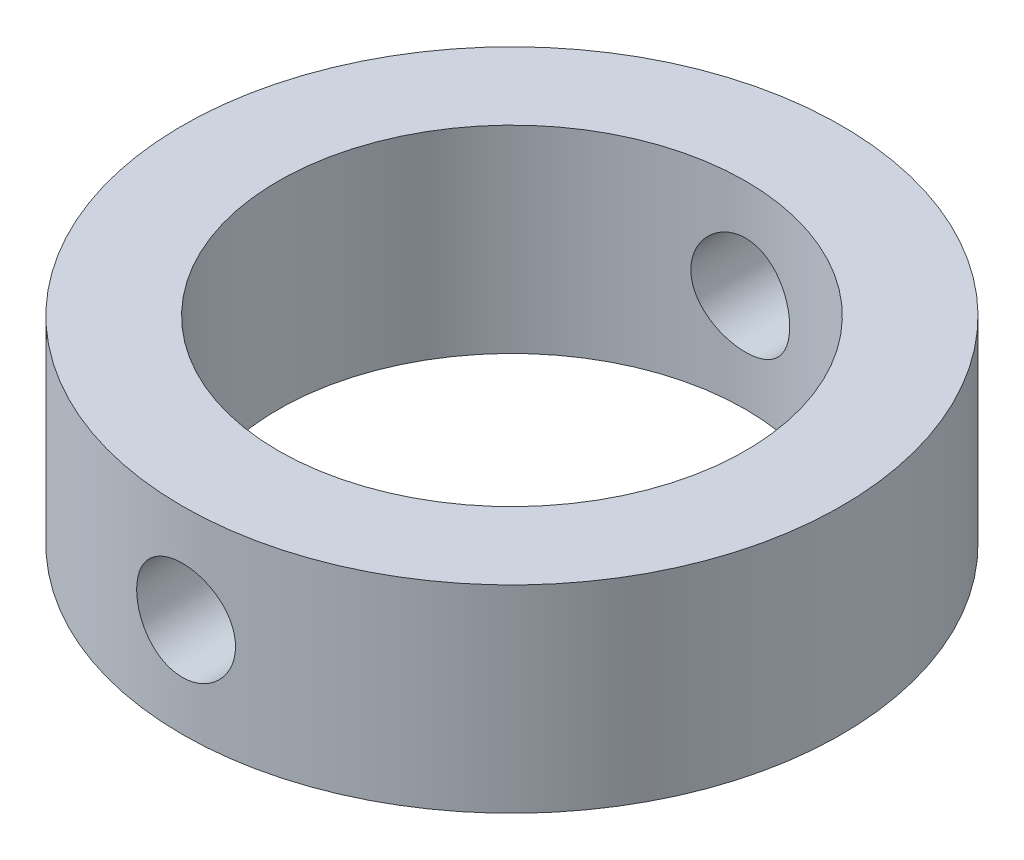
ISO-10303-21;
HEADER;
FILE_DESCRIPTION(('STEP AP214'),'2;1');
FILE_NAME('part.step','',(''),(''),'','','');
FILE_SCHEMA(('AUTOMOTIVE_DESIGN { 1 0 10303 214 1 1 1 1 }'));
ENDSEC;
DATA;
#1=APPLICATION_CONTEXT('core data for automotive mechanical design processes');
#2=APPLICATION_PROTOCOL_DEFINITION('international standard','automotive_design',2000,#1);
#3=PRODUCT_CONTEXT('',#1,'mechanical');
#4=PRODUCT('Part','Part','',(#3));
#5=PRODUCT_RELATED_PRODUCT_CATEGORY('part','',(#4));
#6=PRODUCT_DEFINITION_FORMATION('','',#4);
#7=PRODUCT_DEFINITION_CONTEXT('part definition',#1,'design');
#8=PRODUCT_DEFINITION('design','',#6,#7);
#9=PRODUCT_DEFINITION_SHAPE('','',#8);
#10=(LENGTH_UNIT() NAMED_UNIT(*) SI_UNIT(.MILLI.,.METRE.));
#11=(NAMED_UNIT(*) PLANE_ANGLE_UNIT() SI_UNIT($,.RADIAN.));
#12=(NAMED_UNIT(*) SI_UNIT($,.STERADIAN.) SOLID_ANGLE_UNIT());
#13=UNCERTAINTY_MEASURE_WITH_UNIT(LENGTH_MEASURE(1.E-05),#10,'distance_accuracy_value','');
#14=(GEOMETRIC_REPRESENTATION_CONTEXT(3) GLOBAL_UNCERTAINTY_ASSIGNED_CONTEXT((#13)) GLOBAL_UNIT_ASSIGNED_CONTEXT((#10,
#11,#12)) REPRESENTATION_CONTEXT('',''));
#15=CARTESIAN_POINT('',(0.,0.,0.));
#16=DIRECTION('',(0.,0.,1.));
#17=DIRECTION('',(1.,0.,0.));
#18=AXIS2_PLACEMENT_3D('',#15,#16,#17);
#19=CARTESIAN_POINT('',(0.,7.50000000000001,0.));
#20=DIRECTION('',(0.,1.,0.));
#21=DIRECTION('',(0.,0.,1.));
#22=AXIS2_PLACEMENT_3D('',#19,#20,#21);
#23=PLANE('',#22);
#24=CARTESIAN_POINT('',(0.,7.50000000000001,0.));
#25=DIRECTION('',(0.,1.,0.));
#26=DIRECTION('',(0.,0.,1.));
#27=AXIS2_PLACEMENT_3D('',#24,#25,#26);
#28=CIRCLE('',#27,25.);
#29=CARTESIAN_POINT('',(0.,7.50000000000001,25.));
#30=VERTEX_POINT('',#29);
#31=EDGE_CURVE('E12',#30,#30,#28,.T.);
#32=ORIENTED_EDGE('',*,*,#31,.T.);
#33=EDGE_LOOP('',(#32));
#34=FACE_BOUND('',#33,.T.);
#35=CARTESIAN_POINT('',(0.,7.50000000000001,0.));
#36=DIRECTION('',(0.,1.,0.));
#37=DIRECTION('',(0.,0.,1.));
#38=AXIS2_PLACEMENT_3D('',#35,#36,#37);
#39=CIRCLE('',#38,17.7222);
#40=CARTESIAN_POINT('',(0.,7.50000000000001,17.7222));
#41=VERTEX_POINT('',#40);
#42=EDGE_CURVE('E65',#41,#41,#39,.T.);
#43=ORIENTED_EDGE('',*,*,#42,.F.);
#44=EDGE_LOOP('',(#43));
#45=FACE_BOUND('',#44,.T.);
#46=ADVANCED_FACE('F46',(#34,#45),#23,.T.);
#47=CARTESIAN_POINT('',(0.,-7.50000000000001,0.));
#48=DIRECTION('',(0.,1.,0.));
#49=DIRECTION('',(0.,0.,1.));
#50=AXIS2_PLACEMENT_3D('',#47,#48,#49);
#51=PLANE('',#50);
#52=CARTESIAN_POINT('',(0.,-7.50000000000001,0.));
#53=DIRECTION('',(0.,1.,0.));
#54=DIRECTION('',(0.,0.,1.));
#55=AXIS2_PLACEMENT_3D('',#52,#53,#54);
#56=CIRCLE('',#55,25.);
#57=CARTESIAN_POINT('',(0.,-7.50000000000001,25.));
#58=VERTEX_POINT('',#57);
#59=EDGE_CURVE('E60',#58,#58,#56,.T.);
#60=ORIENTED_EDGE('',*,*,#59,.F.);
#61=EDGE_LOOP('',(#60));
#62=FACE_BOUND('',#61,.T.);
#63=CARTESIAN_POINT('',(0.,-7.50000000000001,0.));
#64=DIRECTION('',(0.,1.,0.));
#65=DIRECTION('',(0.,0.,1.));
#66=AXIS2_PLACEMENT_3D('',#63,#64,#65);
#67=CIRCLE('',#66,17.7222);
#68=CARTESIAN_POINT('',(0.,-7.50000000000001,17.7222));
#69=VERTEX_POINT('',#68);
#70=EDGE_CURVE('E68',#69,#69,#67,.T.);
#71=ORIENTED_EDGE('',*,*,#70,.T.);
#72=EDGE_LOOP('',(#71));
#73=FACE_BOUND('',#72,.T.);
#74=ADVANCED_FACE('F104',(#62,#73),#51,.F.);
#75=CARTESIAN_POINT('',(0.,7.50000000000001,0.));
#76=DIRECTION('',(0.,-1.,0.));
#77=DIRECTION('',(0.,0.,-1.));
#78=AXIS2_PLACEMENT_3D('',#75,#76,#77);
#79=CYLINDRICAL_SURFACE('',#78,25.);
#80=CARTESIAN_POINT('',(0.,3.74999999999998,-25.));
#81=CARTESIAN_POINT('',(-0.209378861204106,3.74999136546187,-24.9999966442824));
#82=CARTESIAN_POINT('',(-0.41887921270533,3.7324049978984,-24.997342063426));
#83=CARTESIAN_POINT('',(-0.832024069987285,3.66254200004314,-24.9870078993297));
#84=CARTESIAN_POINT('',(-1.03566267243558,3.61023159263779,-24.9793234234618));
#85=CARTESIAN_POINT('',(-1.43104521555465,3.47251873758097,-24.9597930304881));
#86=CARTESIAN_POINT('',(-1.62279801956699,3.38714130123514,-24.947950259273));
#87=CARTESIAN_POINT('',(-1.98922607158813,3.18577905145784,-24.9214118977931));
#88=CARTESIAN_POINT('',(-2.16390368681297,3.06979848895659,-24.9067167038193));
#89=CARTESIAN_POINT('',(-2.49261679890531,2.80955683765031,-24.8759792747863));
#90=CARTESIAN_POINT('',(-2.64649958056375,2.66510385947948,-24.8599283472583));
#91=CARTESIAN_POINT('',(-2.92793726672371,2.35243077776534,-24.828356528331));
#92=CARTESIAN_POINT('',(-3.0554906568234,2.18420930805372,-24.8128356674626));
#93=CARTESIAN_POINT('',(-3.28124323749857,1.8277483911938,-24.7839969364681));
#94=CARTESIAN_POINT('',(-3.37929467593011,1.63941438254668,-24.7706902993758));
#95=CARTESIAN_POINT('',(-3.54231580427639,1.24871794838645,-24.7479052826567));
#96=CARTESIAN_POINT('',(-3.60728729722907,1.04635628814029,-24.7384266943862));
#97=CARTESIAN_POINT('',(-3.70182996997278,0.634954895320726,-24.7244564054669));
#98=CARTESIAN_POINT('',(-3.73166259101294,0.425976516479948,-24.7199278935313));
#99=CARTESIAN_POINT('',(-3.75589060084831,0.00593458503179794,-24.7162587242645));
#100=CARTESIAN_POINT('',(-3.75028802434491,-0.205128847156248,-24.7171177575787));
#101=CARTESIAN_POINT('',(-3.70401833126969,-0.621502700485371,-24.7240929588102));
#102=CARTESIAN_POINT('',(-3.66364239819375,-0.826846316212019,-24.7301654690387));
#103=CARTESIAN_POINT('',(-3.54942793509335,-1.22781092217884,-24.7468152031592));
#104=CARTESIAN_POINT('',(-3.4755884584453,-1.42343163720187,-24.7573925544845));
#105=CARTESIAN_POINT('',(-3.29624008824341,-1.80028342820716,-24.781908388637));
#106=CARTESIAN_POINT('',(-3.19060785707994,-1.98145492273098,-24.7958599191632));
#107=CARTESIAN_POINT('',(-2.95076032822386,-2.32361148945484,-24.8255426893637));
#108=CARTESIAN_POINT('',(-2.81654315456195,-2.48459523567344,-24.8412740458125));
#109=CARTESIAN_POINT('',(-2.5217373269562,-2.7834941518493,-24.8729368264052));
#110=CARTESIAN_POINT('',(-2.360898324105,-2.92116247571585,-24.8888686778204));
#111=CARTESIAN_POINT('',(-2.01826772473546,-3.16758983626815,-24.9189911912115));
#112=CARTESIAN_POINT('',(-1.83647603647042,-3.27634874635974,-24.9331818455628));
#113=CARTESIAN_POINT('',(-1.45688649553421,-3.46188271624886,-24.9582378896348));
#114=CARTESIAN_POINT('',(-1.25907919459195,-3.53863872960074,-24.9691012981357));
#115=CARTESIAN_POINT('',(-0.853182956217649,-3.65777347421344,-24.9862622639267));
#116=CARTESIAN_POINT('',(-0.6450947148815,-3.70015452953895,-24.9925601298867));
#117=CARTESIAN_POINT('',(-0.226673919109115,-3.74900807454175,-24.9998395283468));
#118=CARTESIAN_POINT('',(-0.0163818296761745,-3.75581992844831,-25.0008713022597));
#119=CARTESIAN_POINT('',(0.402341694155708,-3.73424248672244,-24.9976390253807));
#120=CARTESIAN_POINT('',(0.610773185954693,-3.70585428082975,-24.9933751385342));
#121=CARTESIAN_POINT('',(1.01883096857852,-3.61496474955615,-24.9800617153833));
#122=CARTESIAN_POINT('',(1.2184949076996,-3.55262875992289,-24.9710353801996));
#123=CARTESIAN_POINT('',(1.6045373966075,-3.39578750634561,-24.9492058914592));
#124=CARTESIAN_POINT('',(1.79091532198775,-3.30128073166592,-24.9364025605391));
#125=CARTESIAN_POINT('',(2.1465874482298,-3.08198443859034,-24.9083170617172));
#126=CARTESIAN_POINT('',(2.31574752472892,-2.95697964996806,-24.8930175406686));
#127=CARTESIAN_POINT('',(2.63080918294427,-2.68053547092813,-24.8616965753041));
#128=CARTESIAN_POINT('',(2.77670941198351,-2.52909454418838,-24.8456750890717));
#129=CARTESIAN_POINT('',(3.04234462392989,-2.20256616705877,-24.8145566076123));
#130=CARTESIAN_POINT('',(3.16185211868553,-2.02729268701307,-24.7994684004397));
#131=CARTESIAN_POINT('',(3.36972823176461,-1.65895989872056,-24.7720804776226));
#132=CARTESIAN_POINT('',(3.4580976914109,-1.46590107119632,-24.7597806866407));
#133=CARTESIAN_POINT('',(3.60083668309858,-1.06815616594216,-24.7394258252161));
#134=CARTESIAN_POINT('',(3.65532592854089,-0.863513847571883,-24.731355825161));
#135=CARTESIAN_POINT('',(3.72913873753966,-0.447852461412236,-24.7203345574451));
#136=CARTESIAN_POINT('',(3.74846472957666,-0.236833835013324,-24.7173829362943));
#137=CARTESIAN_POINT('',(3.751344666736,0.183322658289436,-24.716945815271));
#138=CARTESIAN_POINT('',(3.73525630418282,0.392458104392283,-24.7194056583375));
#139=CARTESIAN_POINT('',(3.66853073860947,0.80501315830877,-24.7293955152794));
#140=CARTESIAN_POINT('',(3.61789359096568,1.00843277528346,-24.7369255210279));
#141=CARTESIAN_POINT('',(3.48363433796663,1.40368270558579,-24.7561881528074));
#142=CARTESIAN_POINT('',(3.40003723310785,1.59552167608359,-24.7679175929019));
#143=CARTESIAN_POINT('',(3.20226669105772,1.96250908450601,-24.7942613639425));
#144=CARTESIAN_POINT('',(3.08809221853755,2.13765695700913,-24.8088757925681));
#145=CARTESIAN_POINT('',(2.83110844147911,2.46810764493795,-24.8395185841234));
#146=CARTESIAN_POINT('',(2.68803422599514,2.62320333311767,-24.8555591970492));
#147=CARTESIAN_POINT('',(2.37787210270709,2.90731138696955,-24.8871447206659));
#148=CARTESIAN_POINT('',(2.21077862087735,3.03631768144039,-24.902689515269));
#149=CARTESIAN_POINT('',(1.8562392688593,3.2652191915184,-24.931629644763));
#150=CARTESIAN_POINT('',(1.6686864419119,3.36495027303686,-24.9450126782205));
#151=CARTESIAN_POINT('',(1.2793796756218,3.53134629189512,-24.968000720074));
#152=CARTESIAN_POINT('',(1.07764069274176,3.59804547513423,-24.9776096391439));
#153=CARTESIAN_POINT('',(0.72916431972332,3.68135335677528,-24.9897734815376));
#154=CARTESIAN_POINT('',(0.584577833738195,3.70705650384704,-24.9935887294889));
#155=CARTESIAN_POINT('',(0.293347429000313,3.7413827442816,-24.9987031486974));
#156=CARTESIAN_POINT('',(0.146703535836043,3.75000604988134,-25.0000023512194));
#157=CARTESIAN_POINT('',(0.,3.74999999999998,-25.));
#158=B_SPLINE_CURVE_WITH_KNOTS('',3,(#80,#81,#82,#83,#84,#85,#86,#87,#88,#89,#90,#91,#92,#93,
#94,#95,#96,#97,#98,#99,#100,#101,#102,#103,#104,#105,#106,#107,#108,#109,#110,#111,#112,#113,
#114,#115,#116,#117,#118,#119,#120,#121,#122,#123,#124,#125,#126,#127,#128,#129,#130,#131,#132,
#133,#134,#135,#136,#137,#138,#139,#140,#141,#142,#143,#144,#145,#146,#147,#148,#149,#150,#151,
#152,#153,#154,#155,#156,#157),.UNSPECIFIED.,.T.,.F.,(4,2,2,2,2,2,2,2,2,2,2,2,2,2,2,2,2,2,2,2,2,
2,2,2,2,2,2,2,2,2,2,2,2,2,2,2,2,2,4),(0.,0.62760051257916,1.25581240732287,1.88355005895809,
2.511200560494,3.14323540342108,3.77530658931448,4.41049255988435,5.04564390563763,
5.67603911514811,6.30639812747458,6.93152942989367,7.55667841725904,8.18428458690398,
8.81193195771337,9.44585728138522,10.0797853809667,10.7140902246219,11.348352179835,
11.9765514636064,12.6047312997789,13.2298787241487,13.8550555094068,14.4847797009227,
15.1145405007157,15.7495341646168,16.3845106702208,17.0172305864292,17.6499068034294,
18.2762222065266,18.9025366057391,19.5283768496037,20.154238286672,20.786120749143,
21.4181500867183,22.0536580846183,22.688505831536,23.1282462994702,23.5679813030823),.UNSPECIFIED.);
#159=CARTESIAN_POINT('',(0.,3.74999999999998,-25.));
#160=VERTEX_POINT('',#159);
#161=EDGE_CURVE('E93',#160,#160,#158,.T.);
#162=ORIENTED_EDGE('',*,*,#161,.T.);
#163=EDGE_LOOP('',(#162));
#164=FACE_BOUND('',#163,.T.);
#165=CARTESIAN_POINT('',(3.75,0.,24.7171499166065));
#166=CARTESIAN_POINT('',(3.74999135268076,-0.209363923243862,24.7171534162569));
#167=CARTESIAN_POINT('',(3.73240740970164,-0.4188493769331,24.7198387912912));
#168=CARTESIAN_POINT('',(3.66255491641441,-0.831963287259849,24.7302828678189));
#169=CARTESIAN_POINT('',(3.61025253506452,-1.03558582871036,24.7380465176796));
#170=CARTESIAN_POINT('',(3.47256315245608,-1.43093438859889,24.757748475261));
#171=CARTESIAN_POINT('',(3.38720154203599,-1.62266940635047,24.7696835784506));
#172=CARTESIAN_POINT('',(3.18587657719372,-1.98906757693512,24.7963798526664));
#173=CARTESIAN_POINT('',(3.06991743574651,-2.16373307553706,24.8111406345481));
#174=CARTESIAN_POINT('',(2.80969756046425,-2.49245954188449,24.8419572312449));
#175=CARTESIAN_POINT('',(2.66524013962059,-2.6463640335165,24.8580215614632));
#176=CARTESIAN_POINT('',(2.35254901361086,-2.9278437141391,24.8895592042144));
#177=CARTESIAN_POINT('',(2.1843140019663,-3.05541745541756,24.9050324842122));
#178=CARTESIAN_POINT('',(1.82784089513188,-3.2811915792283,24.9337336857078));
#179=CARTESIAN_POINT('',(1.63951056841442,-3.37924787580612,24.9469504608901));
#180=CARTESIAN_POINT('',(1.24882212526743,-3.54227899702046,24.9695551686593));
#181=CARTESIAN_POINT('',(1.04646475067669,-3.60725556960723,24.9789433035484));
#182=CARTESIAN_POINT('',(0.635077807726422,-3.70180847132708,24.9927728699448));
#183=CARTESIAN_POINT('',(0.426109710974664,-3.7316468159679,24.9972508971837));
#184=CARTESIAN_POINT('',(0.00608801004869675,-3.75588983706225,25.0008811192395));
#185=CARTESIAN_POINT('',(-0.204965477539366,-3.75029648329923,25.0000336101235));
#186=CARTESIAN_POINT('',(-0.621379295501299,-3.70404165559394,24.9931374915199));
#187=CARTESIAN_POINT('',(-0.826771728500019,-3.66366207052129,24.987130691312));
#188=CARTESIAN_POINT('',(-1.22783207285784,-3.54942348419356,24.9706375056963));
#189=CARTESIAN_POINT('',(-1.42349973378371,-3.4755636212464,24.9601510049935));
#190=CARTESIAN_POINT('',(-1.80040945192579,-3.29617250770726,24.9358048468301));
#191=CARTESIAN_POINT('',(-1.98159418080899,-3.19052258722815,24.921932587891));
#192=CARTESIAN_POINT('',(-2.32376976787545,-2.95063701582503,24.8923609561355));
#193=CARTESIAN_POINT('',(-2.48475929567934,-2.81639948323284,24.8766614630796));
#194=CARTESIAN_POINT('',(-2.78363620680661,-2.52157887793353,24.8450039548157));
#195=CARTESIAN_POINT('',(-2.92128082377367,-2.36074969507472,24.8290449155814));
#196=CARTESIAN_POINT('',(-3.16766498347032,-2.01814730719066,24.7988176113381));
#197=CARTESIAN_POINT('',(-3.27640434819997,-1.83637397320019,24.7845493567412));
#198=CARTESIAN_POINT('',(-3.46192411336512,-1.45679009264838,24.7593193821714));
#199=CARTESIAN_POINT('',(-3.53867955675204,-1.25896716584402,24.7483602461323));
#200=CARTESIAN_POINT('',(-3.65780840522199,-0.853036862131513,24.7310350724765));
#201=CARTESIAN_POINT('',(-3.70018423343315,-0.6449302111331,24.7246687111575));
#202=CARTESIAN_POINT('',(-3.74901800216639,-0.22649977605626,24.7173112848757));
#203=CARTESIAN_POINT('',(-3.75582008162631,-0.0162170294961455,24.7162687200644));
#204=CARTESIAN_POINT('',(-3.73422642549548,0.402485487043363,24.7195401984288));
#205=CARTESIAN_POINT('',(-3.70583178205756,0.610905314626933,24.7238540753945));
#206=CARTESIAN_POINT('',(-3.61494257381915,1.0188995449141,24.7373050615363));
#207=CARTESIAN_POINT('',(-3.55261946319551,1.21851301235403,24.7464179120715));
#208=CARTESIAN_POINT('',(-3.39582079867716,1.60446023012154,24.7684200456442));
#209=CARTESIAN_POINT('',(-3.30134365690972,1.79079332407052,24.7813095151794));
#210=CARTESIAN_POINT('',(-3.08209194988309,2.14643315083763,24.8095338921766));
#211=CARTESIAN_POINT('',(-2.95709461404415,2.31560111819955,24.8248864819997));
#212=CARTESIAN_POINT('',(-2.68066042093003,2.63068214968452,24.8562539858339));
#213=CARTESIAN_POINT('',(-2.52922206861698,2.77659389795286,24.8722689372573));
#214=CARTESIAN_POINT('',(-2.20268904907046,3.04225651658394,24.9033176304347));
#215=CARTESIAN_POINT('',(-2.02740781692989,3.16177932060619,24.9183420865106));
#216=CARTESIAN_POINT('',(-1.6590552006592,3.36968226315661,24.9455726258004));
#217=CARTESIAN_POINT('',(-1.46598430340109,3.45806325366257,24.9577787861141));
#218=CARTESIAN_POINT('',(-1.06824498965286,3.60080935622007,24.9779567415199));
#219=CARTESIAN_POINT('',(-0.863622146885755,3.6552991676959,24.9859440429474));
#220=CARTESIAN_POINT('',(-0.448002038752981,3.72911969884368,24.9968494164225));
#221=CARTESIAN_POINT('',(-0.237005195326448,3.74845274062284,24.9997678232702));
#222=CARTESIAN_POINT('',(0.18316147715204,3.75135426137352,25.0002032264784));
#223=CARTESIAN_POINT('',(0.392328925530112,3.73527170219247,24.9977729255942));
#224=CARTESIAN_POINT('',(0.804949488307786,3.66854652894807,24.9878902629792));
#225=CARTESIAN_POINT('',(1.00840262099135,3.61790402547846,24.9804379173192));
#226=CARTESIAN_POINT('',(1.40372343594909,3.48362031107453,24.9613446685591));
#227=CARTESIAN_POINT('',(1.59559948287171,3.40000326215315,24.9497068329142));
#228=CARTESIAN_POINT('',(1.96265279474175,3.20218128004165,24.9235208623969));
#229=CARTESIAN_POINT('',(2.13782951730268,3.08797535379732,24.9089726330436));
#230=CARTESIAN_POINT('',(2.46828146297899,2.83095575292895,24.878412765869));
#231=CARTESIAN_POINT('',(2.62335516611253,2.68788443546613,24.8623887105156));
#232=CARTESIAN_POINT('',(2.90742020976012,2.37773731729184,24.830775042358));
#233=CARTESIAN_POINT('',(3.03640541998738,2.21065589041309,24.8151855324038));
#234=CARTESIAN_POINT('',(3.26528277056406,1.85612754194085,24.7861121002282));
#235=CARTESIAN_POINT('',(3.36500735723655,1.66857145753498,24.7726405020556));
#236=CARTESIAN_POINT('',(3.53139034675771,1.27925805818213,24.7494727259703));
#237=CARTESIAN_POINT('',(3.59808306436243,1.07751573037934,24.7397726323382));
#238=CARTESIAN_POINT('',(3.68137379725668,0.729056409346079,24.7274871383702));
#239=CARTESIAN_POINT('',(3.70706924451177,0.58449150768439,24.7236312345417));
#240=CARTESIAN_POINT('',(3.74138526441309,0.293304270669045,24.7184614141931));
#241=CARTESIAN_POINT('',(3.75000605837784,0.14668196200793,24.7171474647247));
#242=CARTESIAN_POINT('',(3.75,0.,24.7171499166065));
#243=B_SPLINE_CURVE_WITH_KNOTS('',3,(#165,#166,#167,#168,#169,#170,#171,#172,#173,#174,#175,
#176,#177,#178,#179,#180,#181,#182,#183,#184,#185,#186,#187,#188,#189,#190,#191,#192,#193,#194,
#195,#196,#197,#198,#199,#200,#201,#202,#203,#204,#205,#206,#207,#208,#209,#210,#211,#212,#213,
#214,#215,#216,#217,#218,#219,#220,#221,#222,#223,#224,#225,#226,#227,#228,#229,#230,#231,#232,
#233,#234,#235,#236,#237,#238,#239,#240,#241,#242),.UNSPECIFIED.,.T.,.F.,(4,2,2,2,2,2,2,2,2,2,2,
2,2,2,2,2,2,2,2,2,2,2,2,2,2,2,2,2,2,2,2,2,2,2,2,2,2,2,4),(0.,0.627555629539278,1.25572367395714,
1.88341021339182,2.51101037170595,3.14310396628032,3.77523230524807,4.41039805269719,
5.04553023416515,5.67589581341256,6.30622634853698,6.93149656294584,7.55678287103768,
8.18443290971398,8.81212427378444,9.44598861670937,10.0798568629114,10.7142187943811,
11.3485360111612,11.9767053651462,12.6048552275506,13.229859870237,13.8548953822056,
14.4846371500852,15.1144145365977,15.7494384438905,16.384444976849,17.0171010223299,
17.6497152793145,18.2761240906108,18.9025308973732,19.5284795564985,20.1544485392303,
20.7862737503269,21.4182472559742,22.0537719706901,22.688635086223,23.1283110473742,
23.5679813094887),.UNSPECIFIED.);
#244=CARTESIAN_POINT('',(3.75,0.,24.7171499166065));
#245=VERTEX_POINT('',#244);
#246=EDGE_CURVE('E88',#245,#245,#243,.T.);
#247=ORIENTED_EDGE('',*,*,#246,.T.);
#248=EDGE_LOOP('',(#247));
#249=FACE_BOUND('',#248,.T.);
#250=ORIENTED_EDGE('',*,*,#31,.F.);
#251=EDGE_LOOP('',(#250));
#252=FACE_BOUND('',#251,.T.);
#253=ORIENTED_EDGE('',*,*,#59,.T.);
#254=EDGE_LOOP('',(#253));
#255=FACE_BOUND('',#254,.T.);
#256=ADVANCED_FACE('F48',(#164,#249,#252,#255),#79,.T.);
#257=CARTESIAN_POINT('',(0.,7.50000000000001,0.));
#258=DIRECTION('',(0.,-1.,0.));
#259=DIRECTION('',(0.,0.,-1.));
#260=AXIS2_PLACEMENT_3D('',#257,#258,#259);
#261=CYLINDRICAL_SURFACE('',#260,17.7222);
#262=CARTESIAN_POINT('',(0.,3.74999999999998,-17.7222));
#263=CARTESIAN_POINT('',(-0.208152185255152,3.74999266653267,-17.7221961470917));
#264=CARTESIAN_POINT('',(-0.41639454894016,3.73261053478915,-17.718495379831));
#265=CARTESIAN_POINT('',(-0.82697549267229,3.66360681046194,-17.7040895405869));
#266=CARTESIAN_POINT('',(-1.02930955229037,3.61195968317287,-17.6933792450956));
#267=CARTESIAN_POINT('',(-1.4220797859961,3.47610707502514,-17.6661482075854));
#268=CARTESIAN_POINT('',(-1.612527762323,3.3919345074086,-17.6496333408684));
#269=CARTESIAN_POINT('',(-1.97658898228258,3.1935222719406,-17.6125806048195));
#270=CARTESIAN_POINT('',(-2.15020288067077,3.07928377413531,-17.5920428920488));
#271=CARTESIAN_POINT('',(-2.47829359232655,2.82215911265837,-17.5488523402332));
#272=CARTESIAN_POINT('',(-2.63248026690015,2.67890686784265,-17.5261746803597));
#273=CARTESIAN_POINT('',(-2.91482531722673,2.36860744686158,-17.4814372368369));
#274=CARTESIAN_POINT('',(-3.0429814883738,2.20155825729426,-17.4593775056581));
#275=CARTESIAN_POINT('',(-3.27089013313798,1.84628433118979,-17.4181298435129));
#276=CARTESIAN_POINT('',(-3.37033702804904,1.65785953759665,-17.398973770749));
#277=CARTESIAN_POINT('',(-3.53604503663322,1.26650138054312,-17.3660571970979));
#278=CARTESIAN_POINT('',(-3.60230984632562,1.06356963583257,-17.3522960953235));
#279=CARTESIAN_POINT('',(-3.69882038915951,0.652095534338813,-17.3319797145479));
#280=CARTESIAN_POINT('',(-3.72957803284,0.44367840257558,-17.325322132504));
#281=CARTESIAN_POINT('',(-3.75579222040198,0.0245439529289904,-17.3196590845325));
#282=CARTESIAN_POINT('',(-3.75125281635522,-0.186173098152194,-17.3206527402489));
#283=CARTESIAN_POINT('',(-3.70741447312024,-0.600144024076815,-17.3300871453066));
#284=CARTESIAN_POINT('',(-3.66870712250094,-0.803463870180767,-17.3384011430383));
#285=CARTESIAN_POINT('',(-3.55856755059544,-1.20065708434444,-17.3613393781391));
#286=CARTESIAN_POINT('',(-3.48713359938168,-1.39452995243762,-17.3759639490826));
#287=CARTESIAN_POINT('',(-3.3130169457595,-1.76900525558975,-17.4100022405893));
#288=CARTESIAN_POINT('',(-3.21010404075646,-1.94949733471914,-17.4294510352031));
#289=CARTESIAN_POINT('',(-2.97611287763404,-2.29087060233029,-17.4709244872574));
#290=CARTESIAN_POINT('',(-2.84503101428523,-2.45174927643813,-17.4929494742497));
#291=CARTESIAN_POINT('',(-2.55527727463654,-2.75273797748361,-17.5376395639383));
#292=CARTESIAN_POINT('',(-2.39610160950076,-2.89236288513993,-17.5603086103753));
#293=CARTESIAN_POINT('',(-2.05634155221086,-3.14301199068524,-17.6033266007612));
#294=CARTESIAN_POINT('',(-1.87575681901751,-3.25403573287791,-17.6236755077411));
#295=CARTESIAN_POINT('',(-1.49773346902194,-3.44443897454558,-17.6598199907713));
#296=CARTESIAN_POINT('',(-1.30026354782879,-3.5237580802098,-17.6756068609576));
#297=CARTESIAN_POINT('',(-0.894390959853441,-3.64795660986314,-17.7007833304223));
#298=CARTESIAN_POINT('',(-0.685989782919562,-3.69284071412211,-17.7101737990549));
#299=CARTESIAN_POINT('',(-0.268334585437967,-3.74619689441788,-17.7213767146153));
#300=CARTESIAN_POINT('',(-0.0591688756376419,-3.75533211518441,-17.7233271572078));
#301=CARTESIAN_POINT('',(0.357699882223733,-3.7387241455296,-17.7198156294982));
#302=CARTESIAN_POINT('',(0.565403021980799,-3.71298316160336,-17.7143541281237));
#303=CARTESIAN_POINT('',(0.971276090111958,-3.62790381593627,-17.6967191722838));
#304=CARTESIAN_POINT('',(1.16952157037204,-3.56891032691673,-17.6846146482463));
#305=CARTESIAN_POINT('',(1.55330482716889,-3.41938105298411,-17.6550473164882));
#306=CARTESIAN_POINT('',(1.73884156867098,-3.32884270261685,-17.6375840729719));
#307=CARTESIAN_POINT('',(2.09470415857252,-3.11739146103108,-17.5988945431411));
#308=CARTESIAN_POINT('',(2.26479098769048,-2.99608521007218,-17.5776206615175));
#309=CARTESIAN_POINT('',(2.5824324460133,-2.72706296083509,-17.5337723095124));
#310=CARTESIAN_POINT('',(2.72998434524564,-2.57934376748426,-17.5111976820089));
#311=CARTESIAN_POINT('',(3.00096508318142,-2.25865490461321,-17.4668199433546));
#312=CARTESIAN_POINT('',(3.12393621131072,-2.08529522089939,-17.4450367352952));
#313=CARTESIAN_POINT('',(3.33901833475105,-1.7199930120902,-17.4051527897));
#314=CARTESIAN_POINT('',(3.43113063232395,-1.52805127160994,-17.3870518967809));
#315=CARTESIAN_POINT('',(3.5812796624344,-1.13204333544177,-17.3567474486069));
#316=CARTESIAN_POINT('',(3.63950291210935,-0.928050444144708,-17.3445116801737));
#317=CARTESIAN_POINT('',(3.72077563508814,-0.512886650899571,-17.3272605713025));
#318=CARTESIAN_POINT('',(3.74383032158951,-0.301716817567705,-17.3222441607122));
#319=CARTESIAN_POINT('',(3.75390077642337,0.117199436329279,-17.3200640777949));
#320=CARTESIAN_POINT('',(3.74164125208719,0.324927945921498,-17.3227424916424));
#321=CARTESIAN_POINT('',(3.6830433466586,0.735288357102404,-17.3352948169723));
#322=CARTESIAN_POINT('',(3.63670531509406,0.937920310942116,-17.3451686546543));
#323=CARTESIAN_POINT('',(3.51160559451979,1.33180466845612,-17.3709247713923));
#324=CARTESIAN_POINT('',(3.43294291003997,1.52308979591756,-17.3867886919825));
#325=CARTESIAN_POINT('',(3.2455143852809,1.88985734059801,-17.4227459150073));
#326=CARTESIAN_POINT('',(3.13674564350965,2.06533823251138,-17.4428396250459));
#327=CARTESIAN_POINT('',(2.88976091302207,2.39910281812074,-17.4854685786902));
#328=CARTESIAN_POINT('',(2.75102571999953,2.55699738504185,-17.5080428894493));
#329=CARTESIAN_POINT('',(2.44910638381815,2.84750315660893,-17.5528201552829));
#330=CARTESIAN_POINT('',(2.28591661359643,2.98010852614178,-17.5750230235769));
#331=CARTESIAN_POINT('',(1.93736830904406,3.21778392758599,-17.6168703527083));
#332=CARTESIAN_POINT('',(1.75176776880861,3.32250531498017,-17.6364810034619));
#333=CARTESIAN_POINT('',(1.36522969361138,3.49910204168294,-17.6705978681026));
#334=CARTESIAN_POINT('',(1.16430557538415,3.57100573817274,-17.6851084863342));
#335=CARTESIAN_POINT('',(0.802566208000677,3.66667443463992,-17.7047108510407));
#336=CARTESIAN_POINT('',(0.643749678729262,3.69786345280609,-17.7112295441063));
#337=CARTESIAN_POINT('',(0.323306828576754,3.73952867830156,-17.7199755309738));
#338=CARTESIAN_POINT('',(0.16168061790495,3.75000569621462,-17.722202992717));
#339=CARTESIAN_POINT('',(0.,3.74999999999998,-17.7222));
#340=B_SPLINE_CURVE_WITH_KNOTS('',3,(#262,#263,#264,#265,#266,#267,#268,#269,#270,#271,#272,
#273,#274,#275,#276,#277,#278,#279,#280,#281,#282,#283,#284,#285,#286,#287,#288,#289,#290,#291,
#292,#293,#294,#295,#296,#297,#298,#299,#300,#301,#302,#303,#304,#305,#306,#307,#308,#309,#310,
#311,#312,#313,#314,#315,#316,#317,#318,#319,#320,#321,#322,#323,#324,#325,#326,#327,#328,#329,
#330,#331,#332,#333,#334,#335,#336,#337,#338,#339),.UNSPECIFIED.,.T.,.F.,(4,2,2,2,2,2,2,2,2,2,2,
2,2,2,2,2,2,2,2,2,2,2,2,2,2,2,2,2,2,2,2,2,2,2,2,2,2,2,4),(0.,0.623864874495568,1.24819518393421,
1.87189536666159,2.49557128105162,3.12767066593478,3.7598235630179,4.39847591563496,
5.0370571154976,5.66631208782473,6.29549482327059,6.91399290307351,7.53252368044719,
8.1556904691464,8.77893706195789,9.41477203996356,10.0506171479673,10.687667763103,
11.3246317774797,11.9497224253038,12.5747735276825,13.1934582426495,13.81219328524,
14.4392769101839,15.0664364424179,15.7043646908095,16.3422660148394,16.976622450319,
17.6108848430917,18.2322244050554,18.8535575943087,19.473001771584,20.0925056690176,
20.7237549900906,21.3551497869745,21.9941033399093,22.6325037343333,23.1171049698507,
23.6016872396644),.UNSPECIFIED.);
#341=CARTESIAN_POINT('',(0.,3.74999999999998,-17.7222));
#342=VERTEX_POINT('',#341);
#343=EDGE_CURVE('E51',#342,#342,#340,.T.);
#344=ORIENTED_EDGE('',*,*,#343,.F.);
#345=EDGE_LOOP('',(#344));
#346=FACE_BOUND('',#345,.T.);
#347=CARTESIAN_POINT('',(3.75,0.,17.3209085454545));
#348=CARTESIAN_POINT('',(3.74999262317846,-0.208093377559216,17.3209127403599));
#349=CARTESIAN_POINT('',(3.73261997860774,-0.41627704426552,17.3246994128075));
#350=CARTESIAN_POINT('',(3.66365734999549,-0.82673613295852,17.3394113210448));
#351=CARTESIAN_POINT('',(3.61204159866975,-1.02900698590625,17.35034193242));
#352=CARTESIAN_POINT('',(3.47628071020747,-1.42164331670556,17.378049597833));
#353=CARTESIAN_POINT('',(3.3921699578918,-1.61202113271457,17.3948204701126));
#354=CARTESIAN_POINT('',(3.19390346373044,-1.97596394029922,17.4323116003607));
#355=CARTESIAN_POINT('',(3.07974875129999,-2.14952950764491,17.4530317230068));
#356=CARTESIAN_POINT('',(2.8227102243032,-2.47767122093244,17.4964528436146));
#357=CARTESIAN_POINT('',(2.67944149998641,-2.63194274311314,17.5191777906157));
#358=CARTESIAN_POINT('',(2.36907303755115,-2.9144525696,17.5638379340189));
#359=CARTESIAN_POINT('',(2.20197152130571,-3.04268892973225,17.5857730713415));
#360=CARTESIAN_POINT('',(1.84664821708077,-3.27068435862293,17.6266419499506));
#361=CARTESIAN_POINT('',(1.65823536178029,-3.37015179600751,17.6455441445425));
#362=CARTESIAN_POINT('',(1.26690298543268,-3.53590103120925,17.6779474301966));
#363=CARTESIAN_POINT('',(1.06398498883088,-3.60218631052539,17.6914490878576));
#364=CARTESIAN_POINT('',(0.652567580719959,-3.69873534853722,17.7113608065571));
#365=CARTESIAN_POINT('',(0.444194041340712,-3.7295142314838,17.7178721830305));
#366=CARTESIAN_POINT('',(0.0251460275708574,-3.75578602313321,17.7234202773815));
#367=CARTESIAN_POINT('',(-0.185528197367947,-3.75128272010942,17.7224577977324));
#368=CARTESIAN_POINT('',(-0.599650668847661,-3.70750438089793,17.7132444762233));
#369=CARTESIAN_POINT('',(-0.803160564023222,-3.66878443670728,17.7051099896601));
#370=CARTESIAN_POINT('',(-1.20072724293188,-3.55855488407318,17.6825986819167));
#371=CARTESIAN_POINT('',(-1.39478361731767,-3.48704385713527,17.668221590692));
#372=CARTESIAN_POINT('',(-1.76949226205794,-3.31276204154235,17.6346515461538));
#373=CARTESIAN_POINT('',(-1.95004234186693,-3.20977809359904,17.6154259149491));
#374=CARTESIAN_POINT('',(-2.2915020832145,-2.97563223175987,17.574271331142));
#375=CARTESIAN_POINT('',(-2.45240922613981,-2.84446671036701,17.552342032599));
#376=CARTESIAN_POINT('',(-2.75331424766758,-2.5546498054732,17.5076914056489));
#377=CARTESIAN_POINT('',(-2.89284352514332,-2.3955125821641,17.4849629705469));
#378=CARTESIAN_POINT('',(-3.14331748073308,-2.05586476772887,17.4416780316321));
#379=CARTESIAN_POINT('',(-3.25426148100089,-1.87535366990952,17.4211215793306));
#380=CARTESIAN_POINT('',(-3.44460544567757,-1.4973577262115,17.3844910940221));
#381=CARTESIAN_POINT('',(-3.52392183288319,-1.29982956327181,17.3684289703895));
#382=CARTESIAN_POINT('',(-3.64809745225986,-0.893829338665766,17.3427742763144));
#383=CARTESIAN_POINT('',(-3.69296176518216,-0.68535889553681,17.3331807519537));
#384=CARTESIAN_POINT('',(-3.74624324397612,-0.267660091110112,17.321742710072));
#385=CARTESIAN_POINT('',(-3.75534053082154,-0.0585223454091618,17.3197536124913));
#386=CARTESIAN_POINT('',(-3.73866669739234,0.358281689094897,17.3233603789464));
#387=CARTESIAN_POINT('',(-3.71289780756497,0.565948071169309,17.3289557577907));
#388=CARTESIAN_POINT('',(-3.62781175603405,0.971578538198272,17.3469649281265));
#389=CARTESIAN_POINT('',(-3.56886480360998,1.1696239282128,17.3593034347226));
#390=CARTESIAN_POINT('',(-3.41949479846595,1.55302736673519,17.3893414522287));
#391=CARTESIAN_POINT('',(-3.32906889399048,1.73838426394022,17.4070414488305));
#392=CARTESIAN_POINT('',(-3.11779340887312,2.09410517830178,17.4461285497627));
#393=CARTESIAN_POINT('',(-2.99652228144575,2.26421325550393,17.467565329004));
#394=CARTESIAN_POINT('',(-2.72755439164383,2.58191367667266,17.5115775650937));
#395=CARTESIAN_POINT('',(-2.57985456808567,2.72950340871106,17.5341531536303));
#396=CARTESIAN_POINT('',(-2.25915377249306,3.000593538018,17.5783730388198));
#397=CARTESIAN_POINT('',(-2.08575840667883,3.12363173147599,17.5999943920104));
#398=CARTESIAN_POINT('',(-1.72036426394338,3.33883143800125,17.6394568181403));
#399=CARTESIAN_POINT('',(-1.52836632473975,3.43099434062302,17.6572980611917));
#400=CARTESIAN_POINT('',(-1.13237181293257,3.58117182698285,17.6870928075675));
#401=CARTESIAN_POINT('',(-0.928456948272547,3.63939444068021,17.6990821038446));
#402=CARTESIAN_POINT('',(-0.513459944970105,3.7206922216256,17.7159763748215));
#403=CARTESIAN_POINT('',(-0.302378782011162,3.74377215404811,17.7208823099854));
#404=CARTESIAN_POINT('',(0.116560832719898,3.75392671639739,17.7230308401985));
#405=CARTESIAN_POINT('',(0.324402062843804,3.74169327597626,17.7204207074236));
#406=CARTESIAN_POINT('',(0.734994933660259,3.6831082704523,17.7081436067736));
#407=CARTESIAN_POINT('',(0.937746654628523,3.63675724382879,17.698476750275));
#408=CARTESIAN_POINT('',(1.33191041798982,3.51157522396491,17.6731806640817));
#409=CARTESIAN_POINT('',(1.52335293699509,3.43283654961418,17.6575683907202));
#410=CARTESIAN_POINT('',(1.89040430753438,3.24520668754175,17.6220539549752));
#411=CARTESIAN_POINT('',(2.066011728651,3.13631277944471,17.6021514055916));
#412=CARTESIAN_POINT('',(2.39980151247036,2.88917687962351,17.5597884397093));
#413=CARTESIAN_POINT('',(2.55761616742306,2.75044494942397,17.5372886507353));
#414=CARTESIAN_POINT('',(2.84796223724989,2.44856669830367,17.4924874475652));
#415=CARTESIAN_POINT('',(2.98048759586126,2.28541454589567,17.4701860821035));
#416=CARTESIAN_POINT('',(3.21805989106317,1.93690896749649,17.4280016019896));
#417=CARTESIAN_POINT('',(3.32274774875285,1.75130653135795,17.408151706626));
#418=CARTESIAN_POINT('',(3.49928129047303,1.36476790591703,17.3735304123889));
#419=CARTESIAN_POINT('',(3.57115555676738,1.16384524003873,17.3587545965321));
#420=CARTESIAN_POINT('',(3.6667550315034,0.802180592249884,17.3387719502576));
#421=CARTESIAN_POINT('',(3.69791362140267,0.643441629825071,17.3321164661325));
#422=CARTESIAN_POINT('',(3.73953852764503,0.323153182302085,17.3231832284598));
#423=CARTESIAN_POINT('',(3.75000572878646,0.161603817679431,17.3209052877212));
#424=CARTESIAN_POINT('',(3.75,0.,17.3209085454545));
#425=B_SPLINE_CURVE_WITH_KNOTS('',3,(#347,#348,#349,#350,#351,#352,#353,#354,#355,#356,#357,
#358,#359,#360,#361,#362,#363,#364,#365,#366,#367,#368,#369,#370,#371,#372,#373,#374,#375,#376,
#377,#378,#379,#380,#381,#382,#383,#384,#385,#386,#387,#388,#389,#390,#391,#392,#393,#394,#395,
#396,#397,#398,#399,#400,#401,#402,#403,#404,#405,#406,#407,#408,#409,#410,#411,#412,#413,#414,
#415,#416,#417,#418,#419,#420,#421,#422,#423,#424),.UNSPECIFIED.,.T.,.F.,(4,2,2,2,2,2,2,2,2,2,2,
2,2,2,2,2,2,2,2,2,2,2,2,2,2,2,2,2,2,2,2,2,2,2,2,2,2,2,4),(0.,0.623688090543528,1.24784602759235,
1.87134530840723,2.49482322865155,3.12715391539679,3.75953180403848,4.39811185432497,
5.03662489022361,5.66575306846345,6.29481369768978,6.91385275136084,7.53291858628582,
8.15627379990392,8.77970885623474,9.41529368384851,10.0508935817771,10.6881621200715,
11.3253366603958,11.9503347936719,12.5752929466693,13.1934120958477,13.8115872565353,
14.4387129619278,15.0659113531267,15.7039879007302,16.3420357275908,16.9761304972284,
17.6101392790794,18.2318101300843,18.853471169442,19.4733723505521,20.0933294726496,
20.7243716110697,21.3555646818814,21.9945428733454,22.6329634162214,23.1173358066245,
23.6016874840072),.UNSPECIFIED.);
#426=CARTESIAN_POINT('',(3.75,0.,17.3209085454545));
#427=VERTEX_POINT('',#426);
#428=EDGE_CURVE('E70',#427,#427,#425,.T.);
#429=ORIENTED_EDGE('',*,*,#428,.F.);
#430=EDGE_LOOP('',(#429));
#431=FACE_BOUND('',#430,.T.);
#432=ORIENTED_EDGE('',*,*,#42,.T.);
#433=EDGE_LOOP('',(#432));
#434=FACE_BOUND('',#433,.T.);
#435=ORIENTED_EDGE('',*,*,#70,.F.);
#436=EDGE_LOOP('',(#435));
#437=FACE_BOUND('',#436,.T.);
#438=ADVANCED_FACE('F75',(#346,#431,#434,#437),#261,.F.);
#439=CARTESIAN_POINT('',(0.,0.,-25.));
#440=DIRECTION('',(0.,0.,1.));
#441=DIRECTION('',(1.,0.,0.));
#442=AXIS2_PLACEMENT_3D('',#439,#440,#441);
#443=CYLINDRICAL_SURFACE('',#442,3.75);
#444=ORIENTED_EDGE('',*,*,#428,.T.);
#445=EDGE_LOOP('',(#444));
#446=FACE_BOUND('',#445,.T.);
#447=ORIENTED_EDGE('',*,*,#246,.F.);
#448=EDGE_LOOP('',(#447));
#449=FACE_BOUND('',#448,.T.);
#450=ADVANCED_FACE('F81',(#446,#449),#443,.F.);
#451=ORIENTED_EDGE('',*,*,#343,.T.);
#452=EDGE_LOOP('',(#451));
#453=FACE_BOUND('',#452,.T.);
#454=ORIENTED_EDGE('',*,*,#161,.F.);
#455=EDGE_LOOP('',(#454));
#456=FACE_BOUND('',#455,.T.);
#457=ADVANCED_FACE('F78',(#453,#456),#443,.F.);
#458=CLOSED_SHELL('',(#46,#74,#256,#438,#450,#457));
#459=MANIFOLD_SOLID_BREP('B2',#458);
#460=ADVANCED_BREP_SHAPE_REPRESENTATION('',(#18,#459),#14);
#461=SHAPE_DEFINITION_REPRESENTATION(#9,#460);
ENDSEC;
END-ISO-10303-21;
